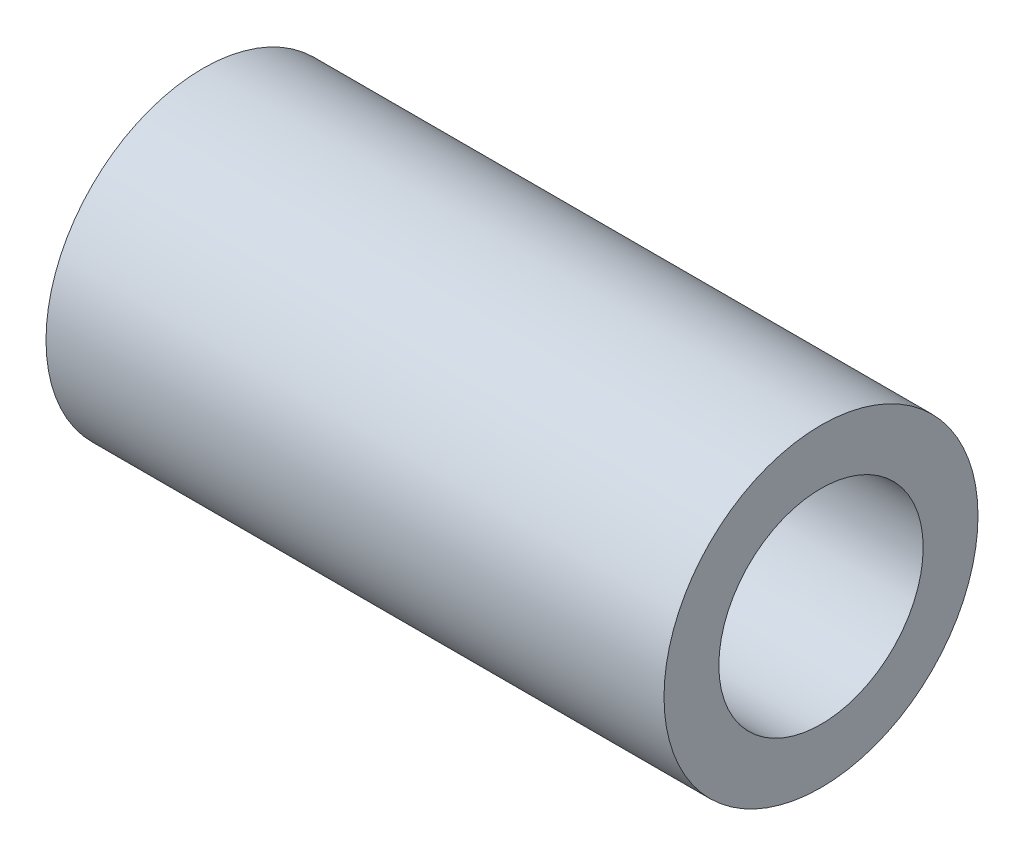
ISO-10303-21;
HEADER;
FILE_DESCRIPTION(('STEP AP214'),'2;1');
FILE_NAME('part.step','',(''),(''),'','','');
FILE_SCHEMA(('AUTOMOTIVE_DESIGN { 1 0 10303 214 1 1 1 1 }'));
ENDSEC;
DATA;
#1=APPLICATION_CONTEXT('core data for automotive mechanical design processes');
#2=APPLICATION_PROTOCOL_DEFINITION('international standard','automotive_design',2000,#1);
#3=PRODUCT_CONTEXT('',#1,'mechanical');
#4=PRODUCT('Part','Part','',(#3));
#5=PRODUCT_RELATED_PRODUCT_CATEGORY('part','',(#4));
#6=PRODUCT_DEFINITION_FORMATION('','',#4);
#7=PRODUCT_DEFINITION_CONTEXT('part definition',#1,'design');
#8=PRODUCT_DEFINITION('design','',#6,#7);
#9=PRODUCT_DEFINITION_SHAPE('','',#8);
#10=(LENGTH_UNIT() NAMED_UNIT(*) SI_UNIT(.MILLI.,.METRE.));
#11=(NAMED_UNIT(*) PLANE_ANGLE_UNIT() SI_UNIT($,.RADIAN.));
#12=(NAMED_UNIT(*) SI_UNIT($,.STERADIAN.) SOLID_ANGLE_UNIT());
#13=UNCERTAINTY_MEASURE_WITH_UNIT(LENGTH_MEASURE(1.E-05),#10,'distance_accuracy_value','');
#14=(GEOMETRIC_REPRESENTATION_CONTEXT(3) GLOBAL_UNCERTAINTY_ASSIGNED_CONTEXT((#13)) GLOBAL_UNIT_ASSIGNED_CONTEXT((#10,
#11,#12)) REPRESENTATION_CONTEXT('',''));
#15=CARTESIAN_POINT('',(0.,0.,0.));
#16=DIRECTION('',(0.,0.,1.));
#17=DIRECTION('',(1.,0.,0.));
#18=AXIS2_PLACEMENT_3D('',#15,#16,#17);
#19=CARTESIAN_POINT('',(-12.4,6.3,0.));
#20=DIRECTION('',(1.,0.,0.));
#21=DIRECTION('',(0.,0.,-1.));
#22=AXIS2_PLACEMENT_3D('',#19,#20,#21);
#23=PLANE('',#22);
#24=CARTESIAN_POINT('',(-12.4,0.,0.));
#25=DIRECTION('',(-1.,0.,0.));
#26=DIRECTION('',(0.,0.,1.));
#27=AXIS2_PLACEMENT_3D('',#24,#25,#26);
#28=CIRCLE('',#27,4.1);
#29=CARTESIAN_POINT('',(-12.4,0.,4.1));
#30=VERTEX_POINT('',#29);
#31=EDGE_CURVE('E10',#30,#30,#28,.T.);
#32=ORIENTED_EDGE('',*,*,#31,.F.);
#33=EDGE_LOOP('',(#32));
#34=FACE_BOUND('',#33,.T.);
#35=CARTESIAN_POINT('',(-12.4,0.,0.));
#36=DIRECTION('',(-1.,0.,0.));
#37=DIRECTION('',(0.,0.,1.));
#38=AXIS2_PLACEMENT_3D('',#35,#36,#37);
#39=CIRCLE('',#38,6.3);
#40=CARTESIAN_POINT('',(-12.4,0.,6.3));
#41=VERTEX_POINT('',#40);
#42=EDGE_CURVE('E57',#41,#41,#39,.T.);
#43=ORIENTED_EDGE('',*,*,#42,.T.);
#44=EDGE_LOOP('',(#43));
#45=FACE_BOUND('',#44,.T.);
#46=ADVANCED_FACE('F39',(#34,#45),#23,.F.);
#47=CARTESIAN_POINT('',(-12.4,0.,0.));
#48=DIRECTION('',(-1.,0.,0.));
#49=DIRECTION('',(0.,0.,1.));
#50=AXIS2_PLACEMENT_3D('',#47,#48,#49);
#51=CYLINDRICAL_SURFACE('',#50,4.1);
#52=CARTESIAN_POINT('',(12.4,0.,0.));
#53=DIRECTION('',(-1.,0.,0.));
#54=DIRECTION('',(0.,0.,1.));
#55=AXIS2_PLACEMENT_3D('',#52,#53,#54);
#56=CIRCLE('',#55,4.1);
#57=CARTESIAN_POINT('',(12.4,0.,4.1));
#58=VERTEX_POINT('',#57);
#59=EDGE_CURVE('E46',#58,#58,#56,.T.);
#60=ORIENTED_EDGE('',*,*,#59,.F.);
#61=EDGE_LOOP('',(#60));
#62=FACE_BOUND('',#61,.T.);
#63=ORIENTED_EDGE('',*,*,#31,.T.);
#64=EDGE_LOOP('',(#63));
#65=FACE_BOUND('',#64,.T.);
#66=ADVANCED_FACE('F72',(#62,#65),#51,.F.);
#67=CARTESIAN_POINT('',(12.4,6.3,0.));
#68=DIRECTION('',(-1.,0.,0.));
#69=DIRECTION('',(0.,0.,1.));
#70=AXIS2_PLACEMENT_3D('',#67,#68,#69);
#71=PLANE('',#70);
#72=CARTESIAN_POINT('',(12.4,0.,0.));
#73=DIRECTION('',(-1.,0.,0.));
#74=DIRECTION('',(0.,0.,1.));
#75=AXIS2_PLACEMENT_3D('',#72,#73,#74);
#76=CIRCLE('',#75,6.3);
#77=CARTESIAN_POINT('',(12.4,0.,6.3));
#78=VERTEX_POINT('',#77);
#79=EDGE_CURVE('E52',#78,#78,#76,.T.);
#80=ORIENTED_EDGE('',*,*,#79,.F.);
#81=EDGE_LOOP('',(#80));
#82=FACE_BOUND('',#81,.T.);
#83=ORIENTED_EDGE('',*,*,#59,.T.);
#84=EDGE_LOOP('',(#83));
#85=FACE_BOUND('',#84,.T.);
#86=ADVANCED_FACE('F67',(#82,#85),#71,.F.);
#87=CARTESIAN_POINT('',(-12.4,0.,0.));
#88=DIRECTION('',(-1.,0.,0.));
#89=DIRECTION('',(0.,0.,1.));
#90=AXIS2_PLACEMENT_3D('',#87,#88,#89);
#91=CYLINDRICAL_SURFACE('',#90,6.3);
#92=ORIENTED_EDGE('',*,*,#42,.F.);
#93=EDGE_LOOP('',(#92));
#94=FACE_BOUND('',#93,.T.);
#95=ORIENTED_EDGE('',*,*,#79,.T.);
#96=EDGE_LOOP('',(#95));
#97=FACE_BOUND('',#96,.T.);
#98=ADVANCED_FACE('F64',(#94,#97),#91,.T.);
#99=CLOSED_SHELL('',(#46,#66,#86,#98));
#100=MANIFOLD_SOLID_BREP('B2',#99);
#101=ADVANCED_BREP_SHAPE_REPRESENTATION('',(#18,#100),#14);
#102=SHAPE_DEFINITION_REPRESENTATION(#9,#101);
ENDSEC;
END-ISO-10303-21;
